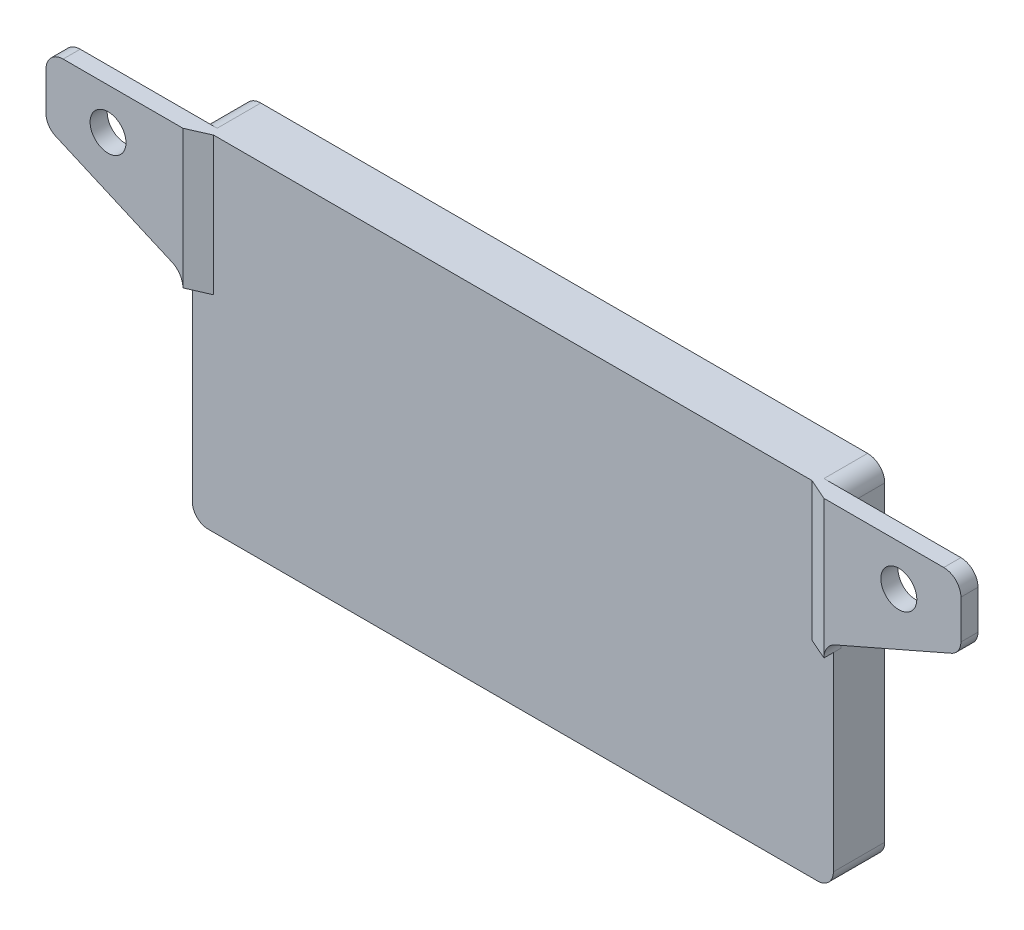
ISO-10303-21;
HEADER;
FILE_DESCRIPTION(('STEP AP214'),'2;1');
FILE_NAME('part.step','',(''),(''),'','','');
FILE_SCHEMA(('AUTOMOTIVE_DESIGN { 1 0 10303 214 1 1 1 1 }'));
ENDSEC;
DATA;
#1=APPLICATION_CONTEXT('core data for automotive mechanical design processes');
#2=APPLICATION_PROTOCOL_DEFINITION('international standard','automotive_design',2000,#1);
#3=PRODUCT_CONTEXT('',#1,'mechanical');
#4=PRODUCT('Part','Part','',(#3));
#5=PRODUCT_RELATED_PRODUCT_CATEGORY('part','',(#4));
#6=PRODUCT_DEFINITION_FORMATION('','',#4);
#7=PRODUCT_DEFINITION_CONTEXT('part definition',#1,'design');
#8=PRODUCT_DEFINITION('design','',#6,#7);
#9=PRODUCT_DEFINITION_SHAPE('','',#8);
#10=(LENGTH_UNIT() NAMED_UNIT(*) SI_UNIT(.MILLI.,.METRE.));
#11=(NAMED_UNIT(*) PLANE_ANGLE_UNIT() SI_UNIT($,.RADIAN.));
#12=(NAMED_UNIT(*) SI_UNIT($,.STERADIAN.) SOLID_ANGLE_UNIT());
#13=UNCERTAINTY_MEASURE_WITH_UNIT(LENGTH_MEASURE(1.E-05),#10,'distance_accuracy_value','');
#14=(GEOMETRIC_REPRESENTATION_CONTEXT(3) GLOBAL_UNCERTAINTY_ASSIGNED_CONTEXT((#13)) GLOBAL_UNIT_ASSIGNED_CONTEXT((#10,
#11,#12)) REPRESENTATION_CONTEXT('',''));
#15=CARTESIAN_POINT('',(0.,0.,0.));
#16=DIRECTION('',(0.,0.,1.));
#17=DIRECTION('',(1.,0.,0.));
#18=AXIS2_PLACEMENT_3D('',#15,#16,#17);
#19=CARTESIAN_POINT('',(-3.05311331771918E-13,7.21644966006352E-13,6.));
#20=DIRECTION('',(0.,0.,-1.));
#21=DIRECTION('',(0.,1.,0.));
#22=AXIS2_PLACEMENT_3D('',#19,#20,#21);
#23=PLANE('',#22);
#24=DIRECTION('',(0.,1.,0.));
#25=VECTOR('',#24,1.);
#26=CARTESIAN_POINT('',(97.4499999999997,133.691968850429,6.00000000000001));
#27=LINE('',#26,#25);
#28=CARTESIAN_POINT('',(97.4499999999997,133.691968850429,6.00000000000001));
#29=VERTEX_POINT('',#28);
#30=CARTESIAN_POINT('',(97.4499999999997,149.850000000001,6.00000000000001));
#31=VERTEX_POINT('',#30);
#32=EDGE_CURVE('E212',#29,#31,#27,.T.);
#33=ORIENTED_EDGE('',*,*,#32,.T.);
#34=DIRECTION('',(1.,0.,0.));
#35=VECTOR('',#34,1.);
#36=CARTESIAN_POINT('',(22.8999999999997,149.850000000001,6.00000000000001));
#37=LINE('',#36,#35);
#38=CARTESIAN_POINT('',(27.5499999999997,149.850000000001,6.00000000000001));
#39=VERTEX_POINT('',#38);
#40=EDGE_CURVE('E284',#39,#31,#37,.T.);
#41=ORIENTED_EDGE('',*,*,#40,.F.);
#42=DIRECTION('',(0.,1.,0.));
#43=VECTOR('',#42,1.);
#44=CARTESIAN_POINT('',(27.5499999999997,133.691968850429,6.00000000000001));
#45=LINE('',#44,#43);
#46=CARTESIAN_POINT('',(27.5499999999997,133.691968850429,6.00000000000001));
#47=VERTEX_POINT('',#46);
#48=EDGE_CURVE('E469',#47,#39,#45,.T.);
#49=ORIENTED_EDGE('',*,*,#48,.F.);
#50=DIRECTION('',(1.,0.,0.));
#51=VECTOR('',#50,1.);
#52=CARTESIAN_POINT('',(0.,133.691968850429,6.00000000000001));
#53=LINE('',#52,#51);
#54=CARTESIAN_POINT('',(25.0499999999997,133.691968850429,6.00000000000001));
#55=VERTEX_POINT('',#54);
#56=EDGE_CURVE('E467',#55,#47,#53,.T.);
#57=ORIENTED_EDGE('',*,*,#56,.F.);
#58=DIRECTION('',(0.,1.,0.));
#59=VECTOR('',#58,1.);
#60=CARTESIAN_POINT('',(25.0499999999997,133.691968850429,6.00000000000001));
#61=LINE('',#60,#59);
#62=CARTESIAN_POINT('',(25.0499999999997,111.500000000001,6.00000000000001));
#63=VERTEX_POINT('',#62);
#64=EDGE_CURVE('E267',#63,#55,#61,.T.);
#65=ORIENTED_EDGE('',*,*,#64,.F.);
#66=CARTESIAN_POINT('',(26.8999999999997,111.500000000001,6.00000000000001));
#67=DIRECTION('',(0.,0.,-1.));
#68=DIRECTION('',(-1.,0.,0.));
#69=AXIS2_PLACEMENT_3D('',#66,#67,#68);
#70=CIRCLE('',#69,1.85000000000001);
#71=CARTESIAN_POINT('',(26.8999999999997,109.650000000001,6.00000000000001));
#72=VERTEX_POINT('',#71);
#73=EDGE_CURVE('E291',#72,#63,#70,.T.);
#74=ORIENTED_EDGE('',*,*,#73,.F.);
#75=DIRECTION('',(-1.,0.,0.));
#76=VECTOR('',#75,1.);
#77=CARTESIAN_POINT('',(26.8999999999997,109.650000000001,6.00000000000001));
#78=LINE('',#77,#76);
#79=CARTESIAN_POINT('',(98.0999999999997,109.650000000001,6.00000000000001));
#80=VERTEX_POINT('',#79);
#81=EDGE_CURVE('E302',#80,#72,#78,.T.);
#82=ORIENTED_EDGE('',*,*,#81,.F.);
#83=CARTESIAN_POINT('',(98.0999999999997,111.500000000001,6.00000000000001));
#84=DIRECTION('',(0.,0.,-1.));
#85=DIRECTION('',(-1.,0.,0.));
#86=AXIS2_PLACEMENT_3D('',#83,#84,#85);
#87=CIRCLE('',#86,1.85);
#88=CARTESIAN_POINT('',(99.9499999999997,111.500000000001,6.00000000000001));
#89=VERTEX_POINT('',#88);
#90=EDGE_CURVE('E230',#89,#80,#87,.T.);
#91=ORIENTED_EDGE('',*,*,#90,.F.);
#92=DIRECTION('',(0.,-1.,0.));
#93=VECTOR('',#92,1.);
#94=CARTESIAN_POINT('',(99.9499999999997,111.500000000001,6.00000000000001));
#95=LINE('',#94,#93);
#96=CARTESIAN_POINT('',(99.9499999999997,133.691968850429,6.00000000000001));
#97=VERTEX_POINT('',#96);
#98=EDGE_CURVE('E219',#97,#89,#95,.T.);
#99=ORIENTED_EDGE('',*,*,#98,.F.);
#100=DIRECTION('',(1.,0.,0.));
#101=VECTOR('',#100,1.);
#102=CARTESIAN_POINT('',(0.,133.691968850429,6.00000000000001));
#103=LINE('',#102,#101);
#104=EDGE_CURVE('E201',#29,#97,#103,.T.);
#105=ORIENTED_EDGE('',*,*,#104,.F.);
#106=EDGE_LOOP('',(#33,#41,#49,#57,#65,#74,#82,#91,#99,#105));
#107=FACE_BOUND('',#106,.T.);
#108=ADVANCED_FACE('F38',(#107),#23,.F.);
#109=CARTESIAN_POINT('',(98.0999999999997,111.500000000001,0.));
#110=DIRECTION('',(0.,0.,1.));
#111=DIRECTION('',(1.,0.,0.));
#112=AXIS2_PLACEMENT_3D('',#109,#110,#111);
#113=PLANE('',#112);
#114=DIRECTION('',(0.,-1.,0.));
#115=VECTOR('',#114,1.);
#116=CARTESIAN_POINT('',(25.0499999999997,148.000000000001,0.));
#117=LINE('',#116,#115);
#118=CARTESIAN_POINT('',(25.0499999999997,147.850000000001,0.));
#119=VERTEX_POINT('',#118);
#120=CARTESIAN_POINT('',(25.0499999999997,111.500000000001,0.));
#121=VERTEX_POINT('',#120);
#122=EDGE_CURVE('E253',#119,#121,#117,.T.);
#123=ORIENTED_EDGE('',*,*,#122,.F.);
#124=CARTESIAN_POINT('',(27.0499999999997,147.850000000001,0.));
#125=DIRECTION('',(0.,0.,1.));
#126=DIRECTION('',(1.,0.,0.));
#127=AXIS2_PLACEMENT_3D('',#124,#125,#126);
#128=CIRCLE('',#127,2.);
#129=CARTESIAN_POINT('',(27.0499999999997,149.850000000001,0.));
#130=VERTEX_POINT('',#129);
#131=EDGE_CURVE('E61',#119,#130,#128,.F.);
#132=ORIENTED_EDGE('',*,*,#131,.T.);
#133=DIRECTION('',(-1.,0.,0.));
#134=VECTOR('',#133,1.);
#135=CARTESIAN_POINT('',(99.9499999999997,149.850000000001,0.));
#136=LINE('',#135,#134);
#137=CARTESIAN_POINT('',(97.9499999999997,149.850000000001,0.));
#138=VERTEX_POINT('',#137);
#139=EDGE_CURVE('E324',#138,#130,#136,.T.);
#140=ORIENTED_EDGE('',*,*,#139,.F.);
#141=CARTESIAN_POINT('',(97.9499999999997,147.850000000001,0.));
#142=DIRECTION('',(0.,0.,1.));
#143=DIRECTION('',(1.,0.,0.));
#144=AXIS2_PLACEMENT_3D('',#141,#142,#143);
#145=CIRCLE('',#144,2.);
#146=CARTESIAN_POINT('',(99.9499999999997,147.850000000001,0.));
#147=VERTEX_POINT('',#146);
#148=EDGE_CURVE('E53',#138,#147,#145,.F.);
#149=ORIENTED_EDGE('',*,*,#148,.T.);
#150=DIRECTION('',(0.,1.,0.));
#151=VECTOR('',#150,1.);
#152=CARTESIAN_POINT('',(99.9499999999997,148.000000000001,0.));
#153=LINE('',#152,#151);
#154=CARTESIAN_POINT('',(99.9499999999997,111.500000000001,0.));
#155=VERTEX_POINT('',#154);
#156=EDGE_CURVE('E322',#155,#147,#153,.T.);
#157=ORIENTED_EDGE('',*,*,#156,.F.);
#158=CARTESIAN_POINT('',(98.0999999999997,111.500000000001,0.));
#159=DIRECTION('',(0.,0.,1.));
#160=DIRECTION('',(1.,0.,0.));
#161=AXIS2_PLACEMENT_3D('',#158,#159,#160);
#162=CIRCLE('',#161,1.85);
#163=CARTESIAN_POINT('',(98.0999999999997,109.650000000001,0.));
#164=VERTEX_POINT('',#163);
#165=EDGE_CURVE('E319',#164,#155,#162,.T.);
#166=ORIENTED_EDGE('',*,*,#165,.F.);
#167=DIRECTION('',(1.,0.,0.));
#168=VECTOR('',#167,1.);
#169=CARTESIAN_POINT('',(26.8999999999997,109.650000000001,0.));
#170=LINE('',#169,#168);
#171=CARTESIAN_POINT('',(26.8999999999997,109.650000000001,0.));
#172=VERTEX_POINT('',#171);
#173=EDGE_CURVE('E316',#172,#164,#170,.T.);
#174=ORIENTED_EDGE('',*,*,#173,.F.);
#175=CARTESIAN_POINT('',(26.8999999999997,111.500000000001,0.));
#176=DIRECTION('',(0.,0.,1.));
#177=DIRECTION('',(1.,0.,0.));
#178=AXIS2_PLACEMENT_3D('',#175,#176,#177);
#179=CIRCLE('',#178,1.85000000000001);
#180=EDGE_CURVE('E313',#121,#172,#179,.T.);
#181=ORIENTED_EDGE('',*,*,#180,.F.);
#182=EDGE_LOOP('',(#123,#132,#140,#149,#157,#166,#174,#181));
#183=FACE_BOUND('',#182,.T.);
#184=ADVANCED_FACE('F383',(#183),#113,.F.);
#185=CARTESIAN_POINT('',(99.9499999999997,149.850000000001,90.1061762461999));
#186=DIRECTION('',(0.,-1.,0.));
#187=DIRECTION('',(1.,0.,0.));
#188=AXIS2_PLACEMENT_3D('',#185,#186,#187);
#189=PLANE('',#188);
#190=DIRECTION('',(0.915315032422767,0.,-0.402738614266015));
#191=VECTOR('',#190,1.);
#192=CARTESIAN_POINT('',(6.68036193029476,149.850000000001,15.1826407506701));
#193=LINE('',#192,#191);
#194=CARTESIAN_POINT('',(25.0499999999997,149.850000000001,7.1));
#195=VERTEX_POINT('',#194);
#196=EDGE_CURVE('E528',#195,#39,#193,.T.);
#197=ORIENTED_EDGE('',*,*,#196,.T.);
#198=ORIENTED_EDGE('',*,*,#40,.T.);
#199=DIRECTION('',(-0.915315032422766,0.,-0.402738614266016));
#200=VECTOR('',#199,1.);
#201=CARTESIAN_POINT('',(13.5944369973188,149.850000000001,-30.8964477211794));
#202=LINE('',#201,#200);
#203=CARTESIAN_POINT('',(99.9499999999997,149.850000000001,7.1));
#204=VERTEX_POINT('',#203);
#205=EDGE_CURVE('E432',#204,#31,#202,.T.);
#206=ORIENTED_EDGE('',*,*,#205,.F.);
#207=DIRECTION('',(-1.,-2.06184276001815E-13,0.));
#208=VECTOR('',#207,1.);
#209=CARTESIAN_POINT('',(99.9499999999997,149.850000000001,7.1));
#210=LINE('',#209,#208);
#211=CARTESIAN_POINT('',(113.95,149.850000000004,7.1));
#212=VERTEX_POINT('',#211);
#213=EDGE_CURVE('E430',#212,#204,#210,.T.);
#214=ORIENTED_EDGE('',*,*,#213,.F.);
#215=DIRECTION('',(0.,0.,-1.));
#216=VECTOR('',#215,1.);
#217=CARTESIAN_POINT('',(113.95,149.850000000001,90.1061762461999));
#218=LINE('',#217,#216);
#219=CARTESIAN_POINT('',(113.95,149.850000000004,5.1));
#220=VERTEX_POINT('',#219);
#221=EDGE_CURVE('E342',#212,#220,#218,.T.);
#222=ORIENTED_EDGE('',*,*,#221,.T.);
#223=DIRECTION('',(-1.,0.,0.));
#224=VECTOR('',#223,1.);
#225=CARTESIAN_POINT('',(22.8999999999997,149.850000000001,5.1));
#226=LINE('',#225,#224);
#227=CARTESIAN_POINT('',(97.9499999999997,149.850000000003,5.1));
#228=VERTEX_POINT('',#227);
#229=EDGE_CURVE('E279',#220,#228,#226,.T.);
#230=ORIENTED_EDGE('',*,*,#229,.T.);
#231=DIRECTION('',(0.,0.,-1.));
#232=VECTOR('',#231,1.);
#233=CARTESIAN_POINT('',(97.9499999999997,149.850000000001,90.1061762461999));
#234=LINE('',#233,#232);
#235=EDGE_CURVE('E311',#228,#138,#234,.T.);
#236=ORIENTED_EDGE('',*,*,#235,.T.);
#237=ORIENTED_EDGE('',*,*,#139,.T.);
#238=DIRECTION('',(0.,0.,-1.));
#239=VECTOR('',#238,1.);
#240=CARTESIAN_POINT('',(27.0499999999997,149.850000000001,90.1061762461999));
#241=LINE('',#240,#239);
#242=CARTESIAN_POINT('',(27.0499999999997,149.850000000001,5.1));
#243=VERTEX_POINT('',#242);
#244=EDGE_CURVE('E337',#130,#243,#241,.F.);
#245=ORIENTED_EDGE('',*,*,#244,.T.);
#246=CARTESIAN_POINT('',(11.0499999999997,149.850000000001,5.1));
#247=VERTEX_POINT('',#246);
#248=EDGE_CURVE('E280',#243,#247,#226,.T.);
#249=ORIENTED_EDGE('',*,*,#248,.T.);
#250=DIRECTION('',(0.,0.,-1.));
#251=VECTOR('',#250,1.);
#252=CARTESIAN_POINT('',(11.0499999999997,149.850000000001,90.1061762461999));
#253=LINE('',#252,#251);
#254=CARTESIAN_POINT('',(11.0499999999997,149.850000000001,7.1));
#255=VERTEX_POINT('',#254);
#256=EDGE_CURVE('E340',#247,#255,#253,.F.);
#257=ORIENTED_EDGE('',*,*,#256,.T.);
#258=DIRECTION('',(-1.,0.,0.));
#259=VECTOR('',#258,1.);
#260=CARTESIAN_POINT('',(11.0499999999997,149.850000000001,7.1));
#261=LINE('',#260,#259);
#262=EDGE_CURVE('E506',#195,#255,#261,.T.);
#263=ORIENTED_EDGE('',*,*,#262,.F.);
#264=EDGE_LOOP('',(#197,#198,#206,#214,#222,#230,#236,#237,#245,#249,#257,#263));
#265=FACE_BOUND('',#264,.T.);
#266=ADVANCED_FACE('F388',(#265),#189,.F.);
#267=CARTESIAN_POINT('',(99.9499999999997,148.000000000001,90.1061762461999));
#268=DIRECTION('',(-1.,0.,0.));
#269=DIRECTION('',(0.,0.,1.));
#270=AXIS2_PLACEMENT_3D('',#267,#268,#269);
#271=PLANE('',#270);
#272=ORIENTED_EDGE('',*,*,#156,.T.);
#273=DIRECTION('',(0.,0.,-1.));
#274=VECTOR('',#273,1.);
#275=CARTESIAN_POINT('',(99.9499999999997,147.850000000001,90.1061762461999));
#276=LINE('',#275,#274);
#277=CARTESIAN_POINT('',(99.9499999999997,147.850000000001,5.10000000000001));
#278=VERTEX_POINT('',#277);
#279=EDGE_CURVE('E358',#147,#278,#276,.F.);
#280=ORIENTED_EDGE('',*,*,#279,.T.);
#281=DIRECTION('',(0.,-1.,0.));
#282=VECTOR('',#281,1.);
#283=CARTESIAN_POINT('',(99.9499999999997,148.000000000001,5.10000000000001));
#284=LINE('',#283,#282);
#285=CARTESIAN_POINT('',(99.9499999999997,133.691968850429,5.1));
#286=VERTEX_POINT('',#285);
#287=EDGE_CURVE('E221',#278,#286,#284,.T.);
#288=ORIENTED_EDGE('',*,*,#287,.T.);
#289=DIRECTION('',(0.,0.,-1.));
#290=VECTOR('',#289,1.);
#291=CARTESIAN_POINT('',(99.9499999999997,133.691968850429,120.208800011208));
#292=LINE('',#291,#290);
#293=EDGE_CURVE('E217',#97,#286,#292,.T.);
#294=ORIENTED_EDGE('',*,*,#293,.F.);
#295=ORIENTED_EDGE('',*,*,#98,.T.);
#296=DIRECTION('',(0.,0.,-1.));
#297=VECTOR('',#296,1.);
#298=CARTESIAN_POINT('',(99.9499999999997,111.500000000001,90.1061762461999));
#299=LINE('',#298,#297);
#300=EDGE_CURVE('E327',#89,#155,#299,.T.);
#301=ORIENTED_EDGE('',*,*,#300,.T.);
#302=EDGE_LOOP('',(#272,#280,#288,#294,#295,#301));
#303=FACE_BOUND('',#302,.T.);
#304=ADVANCED_FACE('F218',(#303),#271,.F.);
#305=CARTESIAN_POINT('',(98.0999999999997,111.500000000001,90.1061762461999));
#306=DIRECTION('',(0.,0.,-1.));
#307=DIRECTION('',(-1.,0.,0.));
#308=AXIS2_PLACEMENT_3D('',#305,#306,#307);
#309=CYLINDRICAL_SURFACE('',#308,1.85);
#310=ORIENTED_EDGE('',*,*,#300,.F.);
#311=ORIENTED_EDGE('',*,*,#90,.T.);
#312=DIRECTION('',(0.,0.,-1.));
#313=VECTOR('',#312,1.);
#314=CARTESIAN_POINT('',(98.0999999999997,109.650000000001,90.1061762461999));
#315=LINE('',#314,#313);
#316=EDGE_CURVE('E329',#80,#164,#315,.T.);
#317=ORIENTED_EDGE('',*,*,#316,.T.);
#318=ORIENTED_EDGE('',*,*,#165,.T.);
#319=EDGE_LOOP('',(#310,#311,#317,#318));
#320=FACE_BOUND('',#319,.T.);
#321=ADVANCED_FACE('F399',(#320),#309,.T.);
#322=CARTESIAN_POINT('',(26.8999999999997,109.650000000001,90.1061762461999));
#323=DIRECTION('',(0.,1.,0.));
#324=DIRECTION('',(0.,0.,1.));
#325=AXIS2_PLACEMENT_3D('',#322,#323,#324);
#326=PLANE('',#325);
#327=ORIENTED_EDGE('',*,*,#316,.F.);
#328=ORIENTED_EDGE('',*,*,#81,.T.);
#329=DIRECTION('',(0.,0.,-1.));
#330=VECTOR('',#329,1.);
#331=CARTESIAN_POINT('',(26.8999999999997,109.650000000001,90.1061762461999));
#332=LINE('',#331,#330);
#333=EDGE_CURVE('E331',#72,#172,#332,.T.);
#334=ORIENTED_EDGE('',*,*,#333,.T.);
#335=ORIENTED_EDGE('',*,*,#173,.T.);
#336=EDGE_LOOP('',(#327,#328,#334,#335));
#337=FACE_BOUND('',#336,.T.);
#338=ADVANCED_FACE('F402',(#337),#326,.F.);
#339=CARTESIAN_POINT('',(26.8999999999997,111.500000000001,90.1061762461999));
#340=DIRECTION('',(0.,0.,-1.));
#341=DIRECTION('',(-1.,0.,0.));
#342=AXIS2_PLACEMENT_3D('',#339,#340,#341);
#343=CYLINDRICAL_SURFACE('',#342,1.85000000000001);
#344=ORIENTED_EDGE('',*,*,#333,.F.);
#345=ORIENTED_EDGE('',*,*,#73,.T.);
#346=DIRECTION('',(0.,0.,-1.));
#347=VECTOR('',#346,1.);
#348=CARTESIAN_POINT('',(25.0499999999997,111.500000000001,90.1061762461999));
#349=LINE('',#348,#347);
#350=EDGE_CURVE('E308',#63,#121,#349,.T.);
#351=ORIENTED_EDGE('',*,*,#350,.T.);
#352=ORIENTED_EDGE('',*,*,#180,.T.);
#353=EDGE_LOOP('',(#344,#345,#351,#352));
#354=FACE_BOUND('',#353,.T.);
#355=ADVANCED_FACE('F406',(#354),#343,.T.);
#356=CARTESIAN_POINT('',(25.0499999999997,148.000000000001,90.1061762461999));
#357=DIRECTION('',(1.,0.,0.));
#358=DIRECTION('',(0.,0.,-1.));
#359=AXIS2_PLACEMENT_3D('',#356,#357,#358);
#360=PLANE('',#359);
#361=DIRECTION('',(0.,1.,0.));
#362=VECTOR('',#361,1.);
#363=CARTESIAN_POINT('',(25.0499999999997,148.000000000001,5.10000000000001));
#364=LINE('',#363,#362);
#365=CARTESIAN_POINT('',(25.0499999999997,133.691968850429,5.1));
#366=VERTEX_POINT('',#365);
#367=CARTESIAN_POINT('',(25.0499999999997,147.850000000001,5.10000000000001));
#368=VERTEX_POINT('',#367);
#369=EDGE_CURVE('E307',#366,#368,#364,.T.);
#370=ORIENTED_EDGE('',*,*,#369,.T.);
#371=DIRECTION('',(0.,0.,-1.));
#372=VECTOR('',#371,1.);
#373=CARTESIAN_POINT('',(25.0499999999997,147.850000000001,90.1061762461999));
#374=LINE('',#373,#372);
#375=EDGE_CURVE('E354',#368,#119,#374,.T.);
#376=ORIENTED_EDGE('',*,*,#375,.T.);
#377=ORIENTED_EDGE('',*,*,#122,.T.);
#378=ORIENTED_EDGE('',*,*,#350,.F.);
#379=ORIENTED_EDGE('',*,*,#64,.T.);
#380=DIRECTION('',(0.,0.,-1.));
#381=VECTOR('',#380,1.);
#382=CARTESIAN_POINT('',(25.0499999999997,133.691968850429,120.208800011208));
#383=LINE('',#382,#381);
#384=EDGE_CURVE('E289',#55,#366,#383,.T.);
#385=ORIENTED_EDGE('',*,*,#384,.T.);
#386=EDGE_LOOP('',(#370,#376,#377,#378,#379,#385));
#387=FACE_BOUND('',#386,.T.);
#388=ADVANCED_FACE('F367',(#387),#360,.F.);
#389=CARTESIAN_POINT('',(10.8999999999997,143.308031149572,5.1));
#390=DIRECTION('',(0.,0.,1.));
#391=DIRECTION('',(1.,0.,0.));
#392=AXIS2_PLACEMENT_3D('',#389,#390,#391);
#393=PLANE('',#392);
#394=ORIENTED_EDGE('',*,*,#229,.F.);
#395=CARTESIAN_POINT('',(113.95,147.850000000001,5.10000000000001));
#396=DIRECTION('',(0.,0.,1.));
#397=DIRECTION('',(1.,0.,0.));
#398=AXIS2_PLACEMENT_3D('',#395,#396,#397);
#399=CIRCLE('',#398,2.);
#400=CARTESIAN_POINT('',(115.95,147.850000000001,5.1));
#401=VERTEX_POINT('',#400);
#402=EDGE_CURVE('E345',#220,#401,#399,.F.);
#403=ORIENTED_EDGE('',*,*,#402,.T.);
#404=DIRECTION('',(0.,1.,0.));
#405=VECTOR('',#404,1.);
#406=CARTESIAN_POINT('',(115.95,148.000000000001,5.1));
#407=LINE('',#406,#405);
#408=CARTESIAN_POINT('',(115.95,143.308031149572,5.1));
#409=VERTEX_POINT('',#408);
#410=EDGE_CURVE('E250',#409,#401,#407,.T.);
#411=ORIENTED_EDGE('',*,*,#410,.F.);
#412=CARTESIAN_POINT('',(114.1,143.308031149572,5.1));
#413=DIRECTION('',(0.,0.,1.));
#414=DIRECTION('',(1.,0.,0.));
#415=AXIS2_PLACEMENT_3D('',#412,#413,#414);
#416=CIRCLE('',#415,1.85);
#417=CARTESIAN_POINT('',(114.841514842936,141.613140080003,5.1));
#418=VERTEX_POINT('',#417);
#419=EDGE_CURVE('E255',#418,#409,#416,.T.);
#420=ORIENTED_EDGE('',*,*,#419,.F.);
#421=DIRECTION('',(0.91615733490219,0.400818834019706,0.));
#422=VECTOR('',#421,1.);
#423=CARTESIAN_POINT('',(101.238239506857,135.661707120469,5.1));
#424=LINE('',#423,#422);
#425=CARTESIAN_POINT('',(101.238239506857,135.661707120469,5.1));
#426=VERTEX_POINT('',#425);
#427=EDGE_CURVE('E259',#426,#418,#424,.T.);
#428=ORIENTED_EDGE('',*,*,#427,.F.);
#429=CARTESIAN_POINT('',(102.1,133.691968850429,5.1));
#430=DIRECTION('',(0.,0.,-1.));
#431=DIRECTION('',(1.,0.,0.));
#432=AXIS2_PLACEMENT_3D('',#429,#430,#431);
#433=CIRCLE('',#432,2.15000000000001);
#434=EDGE_CURVE('E225',#286,#426,#433,.T.);
#435=ORIENTED_EDGE('',*,*,#434,.F.);
#436=ORIENTED_EDGE('',*,*,#287,.F.);
#437=CARTESIAN_POINT('',(97.9499999999997,147.850000000001,5.10000000000001));
#438=DIRECTION('',(0.,0.,1.));
#439=DIRECTION('',(1.,0.,0.));
#440=AXIS2_PLACEMENT_3D('',#437,#438,#439);
#441=CIRCLE('',#440,2.);
#442=EDGE_CURVE('E12',#278,#228,#441,.T.);
#443=ORIENTED_EDGE('',*,*,#442,.T.);
#444=EDGE_LOOP('',(#394,#403,#411,#420,#428,#435,#436,#443));
#445=FACE_BOUND('',#444,.T.);
#446=CARTESIAN_POINT('',(108.7,145.050000000001,5.1));
#447=DIRECTION('',(0.,0.,1.));
#448=DIRECTION('',(1.,0.,0.));
#449=AXIS2_PLACEMENT_3D('',#446,#447,#448);
#450=CIRCLE('',#449,2.1);
#451=CARTESIAN_POINT('',(110.8,145.050000000001,5.1));
#452=VERTEX_POINT('',#451);
#453=EDGE_CURVE('E239',#452,#452,#450,.T.);
#454=ORIENTED_EDGE('',*,*,#453,.T.);
#455=EDGE_LOOP('',(#454));
#456=FACE_BOUND('',#455,.T.);
#457=ADVANCED_FACE('F413',(#445,#456),#393,.F.);
#458=DIRECTION('',(0.,-1.,0.));
#459=VECTOR('',#458,1.);
#460=CARTESIAN_POINT('',(9.04999999999969,148.000000000001,5.1));
#461=LINE('',#460,#459);
#462=CARTESIAN_POINT('',(9.04999999999969,147.850000000001,5.1));
#463=VERTEX_POINT('',#462);
#464=CARTESIAN_POINT('',(9.04999999999969,143.308031149572,5.1));
#465=VERTEX_POINT('',#464);
#466=EDGE_CURVE('E277',#463,#465,#461,.T.);
#467=ORIENTED_EDGE('',*,*,#466,.F.);
#468=CARTESIAN_POINT('',(11.0499999999997,147.850000000001,5.10000000000001));
#469=DIRECTION('',(0.,0.,1.));
#470=DIRECTION('',(1.,0.,0.));
#471=AXIS2_PLACEMENT_3D('',#468,#469,#470);
#472=CIRCLE('',#471,2.);
#473=EDGE_CURVE('E352',#463,#247,#472,.F.);
#474=ORIENTED_EDGE('',*,*,#473,.T.);
#475=ORIENTED_EDGE('',*,*,#248,.F.);
#476=CARTESIAN_POINT('',(27.0499999999997,147.850000000001,5.10000000000001));
#477=DIRECTION('',(0.,0.,1.));
#478=DIRECTION('',(1.,0.,0.));
#479=AXIS2_PLACEMENT_3D('',#476,#477,#478);
#480=CIRCLE('',#479,2.);
#481=EDGE_CURVE('E46',#243,#368,#480,.T.);
#482=ORIENTED_EDGE('',*,*,#481,.T.);
#483=ORIENTED_EDGE('',*,*,#369,.F.);
#484=CARTESIAN_POINT('',(22.8999999999997,133.691968850429,5.1));
#485=DIRECTION('',(0.,0.,-1.));
#486=DIRECTION('',(1.,0.,0.));
#487=AXIS2_PLACEMENT_3D('',#484,#485,#486);
#488=CIRCLE('',#487,2.15);
#489=CARTESIAN_POINT('',(23.7617604931421,135.661707120469,5.1));
#490=VERTEX_POINT('',#489);
#491=EDGE_CURVE('E264',#490,#366,#488,.T.);
#492=ORIENTED_EDGE('',*,*,#491,.F.);
#493=DIRECTION('',(0.91615733490219,-0.400818834019706,0.));
#494=VECTOR('',#493,1.);
#495=CARTESIAN_POINT('',(10.1584851570632,141.613140080003,5.1));
#496=LINE('',#495,#494);
#497=CARTESIAN_POINT('',(10.1584851570632,141.613140080003,5.1));
#498=VERTEX_POINT('',#497);
#499=EDGE_CURVE('E269',#498,#490,#496,.T.);
#500=ORIENTED_EDGE('',*,*,#499,.F.);
#501=CARTESIAN_POINT('',(10.8999999999997,143.308031149572,5.1));
#502=DIRECTION('',(0.,0.,1.));
#503=DIRECTION('',(1.,0.,0.));
#504=AXIS2_PLACEMENT_3D('',#501,#502,#503);
#505=CIRCLE('',#504,1.85);
#506=EDGE_CURVE('E273',#465,#498,#505,.T.);
#507=ORIENTED_EDGE('',*,*,#506,.F.);
#508=EDGE_LOOP('',(#467,#474,#475,#482,#483,#492,#500,#507));
#509=FACE_BOUND('',#508,.T.);
#510=CARTESIAN_POINT('',(16.2999999999997,145.050000000001,5.1));
#511=DIRECTION('',(0.,0.,1.));
#512=DIRECTION('',(1.,0.,0.));
#513=AXIS2_PLACEMENT_3D('',#510,#511,#512);
#514=CIRCLE('',#513,2.1);
#515=CARTESIAN_POINT('',(18.3999999999997,145.050000000001,5.1));
#516=VERTEX_POINT('',#515);
#517=EDGE_CURVE('E236',#516,#516,#514,.T.);
#518=ORIENTED_EDGE('',*,*,#517,.T.);
#519=EDGE_LOOP('',(#518));
#520=FACE_BOUND('',#519,.T.);
#521=ADVANCED_FACE('F362',(#509,#520),#393,.F.);
#522=CARTESIAN_POINT('',(9.04999999999969,148.000000000001,120.208800011208));
#523=DIRECTION('',(1.,0.,0.));
#524=DIRECTION('',(0.,0.,-1.));
#525=AXIS2_PLACEMENT_3D('',#522,#523,#524);
#526=PLANE('',#525);
#527=DIRECTION('',(0.,0.,-1.));
#528=VECTOR('',#527,1.);
#529=CARTESIAN_POINT('',(9.04999999999969,143.308031149572,120.208800011208));
#530=LINE('',#529,#528);
#531=CARTESIAN_POINT('',(9.04999999999969,143.308031149572,7.1));
#532=VERTEX_POINT('',#531);
#533=EDGE_CURVE('E276',#532,#465,#530,.T.);
#534=ORIENTED_EDGE('',*,*,#533,.F.);
#535=DIRECTION('',(0.,-1.,0.));
#536=VECTOR('',#535,1.);
#537=CARTESIAN_POINT('',(9.04999999999969,143.308031149572,7.1));
#538=LINE('',#537,#536);
#539=CARTESIAN_POINT('',(9.04999999999969,147.850000000001,7.1));
#540=VERTEX_POINT('',#539);
#541=EDGE_CURVE('E496',#540,#532,#538,.T.);
#542=ORIENTED_EDGE('',*,*,#541,.F.);
#543=DIRECTION('',(0.,0.,-1.));
#544=VECTOR('',#543,1.);
#545=CARTESIAN_POINT('',(9.04999999999969,147.850000000001,120.208800011208));
#546=LINE('',#545,#544);
#547=EDGE_CURVE('E349',#540,#463,#546,.T.);
#548=ORIENTED_EDGE('',*,*,#547,.T.);
#549=ORIENTED_EDGE('',*,*,#466,.T.);
#550=EDGE_LOOP('',(#534,#542,#548,#549));
#551=FACE_BOUND('',#550,.T.);
#552=ADVANCED_FACE('F495',(#551),#526,.F.);
#553=CARTESIAN_POINT('',(10.8999999999997,143.308031149572,120.208800011208));
#554=DIRECTION('',(0.,0.,-1.));
#555=DIRECTION('',(-1.,0.,0.));
#556=AXIS2_PLACEMENT_3D('',#553,#554,#555);
#557=CYLINDRICAL_SURFACE('',#556,1.85);
#558=DIRECTION('',(0.,0.,-1.));
#559=VECTOR('',#558,1.);
#560=CARTESIAN_POINT('',(10.1584851570632,141.613140080003,120.208800011208));
#561=LINE('',#560,#559);
#562=CARTESIAN_POINT('',(10.1584851570632,141.613140080003,7.1));
#563=VERTEX_POINT('',#562);
#564=EDGE_CURVE('E272',#563,#498,#561,.T.);
#565=ORIENTED_EDGE('',*,*,#564,.F.);
#566=CARTESIAN_POINT('',(10.8999999999997,143.308031149572,7.1));
#567=DIRECTION('',(0.,0.,1.));
#568=DIRECTION('',(1.,0.,0.));
#569=AXIS2_PLACEMENT_3D('',#566,#567,#568);
#570=CIRCLE('',#569,1.85);
#571=EDGE_CURVE('E491',#532,#563,#570,.T.);
#572=ORIENTED_EDGE('',*,*,#571,.F.);
#573=ORIENTED_EDGE('',*,*,#533,.T.);
#574=ORIENTED_EDGE('',*,*,#506,.T.);
#575=EDGE_LOOP('',(#565,#572,#573,#574));
#576=FACE_BOUND('',#575,.T.);
#577=ADVANCED_FACE('F490',(#576),#557,.T.);
#578=CARTESIAN_POINT('',(10.1584851570632,141.613140080003,120.208800011208));
#579=DIRECTION('',(0.400818834019706,0.91615733490219,0.));
#580=DIRECTION('',(-0.91615733490219,0.400818834019706,0.));
#581=AXIS2_PLACEMENT_3D('',#578,#579,#580);
#582=PLANE('',#581);
#583=DIRECTION('',(0.,0.,-1.));
#584=VECTOR('',#583,1.);
#585=CARTESIAN_POINT('',(23.7617604931421,135.661707120469,120.208800011208));
#586=LINE('',#585,#584);
#587=CARTESIAN_POINT('',(23.7617604931421,135.661707120469,7.1));
#588=VERTEX_POINT('',#587);
#589=EDGE_CURVE('E268',#588,#490,#586,.T.);
#590=ORIENTED_EDGE('',*,*,#589,.F.);
#591=DIRECTION('',(0.91615733490219,-0.400818834019706,0.));
#592=VECTOR('',#591,1.);
#593=CARTESIAN_POINT('',(23.7617604931421,135.661707120469,7.1));
#594=LINE('',#593,#592);
#595=EDGE_CURVE('E486',#563,#588,#594,.T.);
#596=ORIENTED_EDGE('',*,*,#595,.F.);
#597=ORIENTED_EDGE('',*,*,#564,.T.);
#598=ORIENTED_EDGE('',*,*,#499,.T.);
#599=EDGE_LOOP('',(#590,#596,#597,#598));
#600=FACE_BOUND('',#599,.T.);
#601=ADVANCED_FACE('F483',(#600),#582,.F.);
#602=CARTESIAN_POINT('',(22.8999999999997,133.691968850429,120.208800011208));
#603=DIRECTION('',(0.,0.,-1.));
#604=DIRECTION('',(-1.,0.,0.));
#605=AXIS2_PLACEMENT_3D('',#602,#603,#604);
#606=CYLINDRICAL_SURFACE('',#605,2.15);
#607=ORIENTED_EDGE('',*,*,#384,.F.);
#608=DIRECTION('',(0.,0.,-1.));
#609=VECTOR('',#608,1.);
#610=CARTESIAN_POINT('',(25.0499999999997,133.691968850429,31.8394364624691));
#611=LINE('',#610,#609);
#612=CARTESIAN_POINT('',(25.0499999999997,133.691968850429,7.1));
#613=VERTEX_POINT('',#612);
#614=EDGE_CURVE('E249',#613,#55,#611,.T.);
#615=ORIENTED_EDGE('',*,*,#614,.F.);
#616=CARTESIAN_POINT('',(22.8999999999997,133.691968850429,7.1));
#617=DIRECTION('',(0.,0.,1.));
#618=DIRECTION('',(1.,0.,0.));
#619=AXIS2_PLACEMENT_3D('',#616,#617,#618);
#620=CIRCLE('',#619,2.15);
#621=EDGE_CURVE('E511',#588,#613,#620,.F.);
#622=ORIENTED_EDGE('',*,*,#621,.F.);
#623=ORIENTED_EDGE('',*,*,#589,.T.);
#624=ORIENTED_EDGE('',*,*,#491,.T.);
#625=EDGE_LOOP('',(#607,#615,#622,#623,#624));
#626=FACE_BOUND('',#625,.T.);
#627=ADVANCED_FACE('F477',(#626),#606,.F.);
#628=CARTESIAN_POINT('',(102.1,133.691968850429,120.208800011208));
#629=DIRECTION('',(0.,0.,-1.));
#630=DIRECTION('',(-1.,0.,0.));
#631=AXIS2_PLACEMENT_3D('',#628,#629,#630);
#632=CYLINDRICAL_SURFACE('',#631,2.15000000000001);
#633=DIRECTION('',(0.,0.,-1.));
#634=VECTOR('',#633,1.);
#635=CARTESIAN_POINT('',(101.238239506857,135.661707120469,120.208800011208));
#636=LINE('',#635,#634);
#637=CARTESIAN_POINT('',(101.238239506857,135.661707120469,7.1));
#638=VERTEX_POINT('',#637);
#639=EDGE_CURVE('E262',#638,#426,#636,.T.);
#640=ORIENTED_EDGE('',*,*,#639,.F.);
#641=CARTESIAN_POINT('',(102.1,133.691968850429,7.1));
#642=DIRECTION('',(0.,0.,1.));
#643=DIRECTION('',(1.,0.,0.));
#644=AXIS2_PLACEMENT_3D('',#641,#642,#643);
#645=CIRCLE('',#644,2.15000000000001);
#646=CARTESIAN_POINT('',(99.9499999999997,133.691968850429,7.1));
#647=VERTEX_POINT('',#646);
#648=EDGE_CURVE('E234',#647,#638,#645,.F.);
#649=ORIENTED_EDGE('',*,*,#648,.F.);
#650=DIRECTION('',(0.,0.,-1.));
#651=VECTOR('',#650,1.);
#652=CARTESIAN_POINT('',(99.9499999999997,133.691968850429,31.8394364624691));
#653=LINE('',#652,#651);
#654=EDGE_CURVE('E205',#647,#97,#653,.T.);
#655=ORIENTED_EDGE('',*,*,#654,.T.);
#656=ORIENTED_EDGE('',*,*,#293,.T.);
#657=ORIENTED_EDGE('',*,*,#434,.T.);
#658=EDGE_LOOP('',(#640,#649,#655,#656,#657));
#659=FACE_BOUND('',#658,.T.);
#660=ADVANCED_FACE('F232',(#659),#632,.F.);
#661=CARTESIAN_POINT('',(101.238239506857,135.661707120469,120.208800011208));
#662=DIRECTION('',(-0.400818834019706,0.91615733490219,0.));
#663=DIRECTION('',(-0.91615733490219,-0.400818834019706,0.));
#664=AXIS2_PLACEMENT_3D('',#661,#662,#663);
#665=PLANE('',#664);
#666=DIRECTION('',(0.,0.,-1.));
#667=VECTOR('',#666,1.);
#668=CARTESIAN_POINT('',(114.841514842936,141.613140080003,120.208800011208));
#669=LINE('',#668,#667);
#670=CARTESIAN_POINT('',(114.841514842936,141.613140080003,7.1));
#671=VERTEX_POINT('',#670);
#672=EDGE_CURVE('E258',#671,#418,#669,.T.);
#673=ORIENTED_EDGE('',*,*,#672,.F.);
#674=DIRECTION('',(0.91615733490219,0.400818834019706,0.));
#675=VECTOR('',#674,1.);
#676=CARTESIAN_POINT('',(114.841514842936,141.613140080003,7.1));
#677=LINE('',#676,#675);
#678=EDGE_CURVE('E241',#638,#671,#677,.T.);
#679=ORIENTED_EDGE('',*,*,#678,.F.);
#680=ORIENTED_EDGE('',*,*,#639,.T.);
#681=ORIENTED_EDGE('',*,*,#427,.T.);
#682=EDGE_LOOP('',(#673,#679,#680,#681));
#683=FACE_BOUND('',#682,.T.);
#684=ADVANCED_FACE('F447',(#683),#665,.F.);
#685=CARTESIAN_POINT('',(114.1,143.308031149572,120.208800011208));
#686=DIRECTION('',(0.,0.,-1.));
#687=DIRECTION('',(-1.,0.,0.));
#688=AXIS2_PLACEMENT_3D('',#685,#686,#687);
#689=CYLINDRICAL_SURFACE('',#688,1.85);
#690=DIRECTION('',(0.,0.,-1.));
#691=VECTOR('',#690,1.);
#692=CARTESIAN_POINT('',(115.95,143.308031149572,120.208800011208));
#693=LINE('',#692,#691);
#694=CARTESIAN_POINT('',(115.95,143.308031149572,7.1));
#695=VERTEX_POINT('',#694);
#696=EDGE_CURVE('E254',#695,#409,#693,.T.);
#697=ORIENTED_EDGE('',*,*,#696,.F.);
#698=CARTESIAN_POINT('',(114.1,143.308031149572,7.1));
#699=DIRECTION('',(0.,0.,1.));
#700=DIRECTION('',(1.,0.,0.));
#701=AXIS2_PLACEMENT_3D('',#698,#699,#700);
#702=CIRCLE('',#701,1.85);
#703=EDGE_CURVE('E439',#671,#695,#702,.T.);
#704=ORIENTED_EDGE('',*,*,#703,.F.);
#705=ORIENTED_EDGE('',*,*,#672,.T.);
#706=ORIENTED_EDGE('',*,*,#419,.T.);
#707=EDGE_LOOP('',(#697,#704,#705,#706));
#708=FACE_BOUND('',#707,.T.);
#709=ADVANCED_FACE('F451',(#708),#689,.T.);
#710=CARTESIAN_POINT('',(115.95,148.000000000001,120.208800011208));
#711=DIRECTION('',(-1.,0.,0.));
#712=DIRECTION('',(0.,0.,1.));
#713=AXIS2_PLACEMENT_3D('',#710,#711,#712);
#714=PLANE('',#713);
#715=ORIENTED_EDGE('',*,*,#410,.T.);
#716=DIRECTION('',(0.,0.,-1.));
#717=VECTOR('',#716,1.);
#718=CARTESIAN_POINT('',(115.95,147.850000000001,120.208800011208));
#719=LINE('',#718,#717);
#720=CARTESIAN_POINT('',(115.950000000001,147.850000000001,7.1));
#721=VERTEX_POINT('',#720);
#722=EDGE_CURVE('E347',#401,#721,#719,.F.);
#723=ORIENTED_EDGE('',*,*,#722,.T.);
#724=DIRECTION('',(0.,1.,0.));
#725=VECTOR('',#724,1.);
#726=CARTESIAN_POINT('',(115.95,147.850000000001,7.1));
#727=LINE('',#726,#725);
#728=EDGE_CURVE('E437',#695,#721,#727,.T.);
#729=ORIENTED_EDGE('',*,*,#728,.F.);
#730=ORIENTED_EDGE('',*,*,#696,.T.);
#731=EDGE_LOOP('',(#715,#723,#729,#730));
#732=FACE_BOUND('',#731,.T.);
#733=ADVANCED_FACE('F454',(#732),#714,.F.);
#734=CARTESIAN_POINT('',(16.2999999999997,145.050000000001,120.208800011208));
#735=DIRECTION('',(0.,0.,-1.));
#736=DIRECTION('',(-1.,0.,0.));
#737=AXIS2_PLACEMENT_3D('',#734,#735,#736);
#738=CYLINDRICAL_SURFACE('',#737,2.1);
#739=ORIENTED_EDGE('',*,*,#517,.F.);
#740=EDGE_LOOP('',(#739));
#741=FACE_BOUND('',#740,.T.);
#742=CARTESIAN_POINT('',(16.2999999999997,145.050000000001,7.1));
#743=DIRECTION('',(0.,0.,1.));
#744=DIRECTION('',(1.,0.,0.));
#745=AXIS2_PLACEMENT_3D('',#742,#743,#744);
#746=CIRCLE('',#745,2.09999999999999);
#747=CARTESIAN_POINT('',(18.3999999999997,145.050000000001,7.1));
#748=VERTEX_POINT('',#747);
#749=EDGE_CURVE('E509',#748,#748,#746,.T.);
#750=ORIENTED_EDGE('',*,*,#749,.T.);
#751=EDGE_LOOP('',(#750));
#752=FACE_BOUND('',#751,.T.);
#753=ADVANCED_FACE('F419',(#741,#752),#738,.F.);
#754=CARTESIAN_POINT('',(108.7,145.050000000001,120.208800011208));
#755=DIRECTION('',(0.,0.,-1.));
#756=DIRECTION('',(-1.,0.,0.));
#757=AXIS2_PLACEMENT_3D('',#754,#755,#756);
#758=CYLINDRICAL_SURFACE('',#757,2.1);
#759=ORIENTED_EDGE('',*,*,#453,.F.);
#760=EDGE_LOOP('',(#759));
#761=FACE_BOUND('',#760,.T.);
#762=CARTESIAN_POINT('',(108.7,145.050000000001,7.1));
#763=DIRECTION('',(0.,0.,1.));
#764=DIRECTION('',(1.,0.,0.));
#765=AXIS2_PLACEMENT_3D('',#762,#763,#764);
#766=CIRCLE('',#765,2.1);
#767=CARTESIAN_POINT('',(110.8,145.050000000001,7.1));
#768=VERTEX_POINT('',#767);
#769=EDGE_CURVE('E245',#768,#768,#766,.T.);
#770=ORIENTED_EDGE('',*,*,#769,.T.);
#771=EDGE_LOOP('',(#770));
#772=FACE_BOUND('',#771,.T.);
#773=ADVANCED_FACE('F391',(#761,#772),#758,.F.);
#774=CARTESIAN_POINT('',(113.95,147.850000000001,90.1061762461999));
#775=DIRECTION('',(0.,0.,-1.));
#776=DIRECTION('',(-1.,0.,0.));
#777=AXIS2_PLACEMENT_3D('',#774,#775,#776);
#778=CYLINDRICAL_SURFACE('',#777,2.);
#779=ORIENTED_EDGE('',*,*,#221,.F.);
#780=CARTESIAN_POINT('',(113.95,147.850000000001,7.1));
#781=DIRECTION('',(0.,0.,1.));
#782=DIRECTION('',(1.,0.,0.));
#783=AXIS2_PLACEMENT_3D('',#780,#781,#782);
#784=CIRCLE('',#783,2.00000000000147);
#785=EDGE_CURVE('E425',#721,#212,#784,.T.);
#786=ORIENTED_EDGE('',*,*,#785,.F.);
#787=ORIENTED_EDGE('',*,*,#722,.F.);
#788=ORIENTED_EDGE('',*,*,#402,.F.);
#789=EDGE_LOOP('',(#779,#786,#787,#788));
#790=FACE_BOUND('',#789,.T.);
#791=ADVANCED_FACE('F379',(#790),#778,.T.);
#792=CARTESIAN_POINT('',(11.0499999999997,147.850000000001,120.208800011208));
#793=DIRECTION('',(0.,0.,-1.));
#794=DIRECTION('',(-1.,0.,0.));
#795=AXIS2_PLACEMENT_3D('',#792,#793,#794);
#796=CYLINDRICAL_SURFACE('',#795,2.);
#797=ORIENTED_EDGE('',*,*,#547,.F.);
#798=CARTESIAN_POINT('',(11.0499999999997,147.850000000001,7.1));
#799=DIRECTION('',(0.,0.,1.));
#800=DIRECTION('',(1.,0.,0.));
#801=AXIS2_PLACEMENT_3D('',#798,#799,#800);
#802=CIRCLE('',#801,2.00000000000004);
#803=EDGE_CURVE('E501',#255,#540,#802,.T.);
#804=ORIENTED_EDGE('',*,*,#803,.F.);
#805=ORIENTED_EDGE('',*,*,#256,.F.);
#806=ORIENTED_EDGE('',*,*,#473,.F.);
#807=EDGE_LOOP('',(#797,#804,#805,#806));
#808=FACE_BOUND('',#807,.T.);
#809=ADVANCED_FACE('F372',(#808),#796,.T.);
#810=CARTESIAN_POINT('',(27.0499999999997,147.850000000001,90.1061762461999));
#811=DIRECTION('',(0.,0.,-1.));
#812=DIRECTION('',(-1.,0.,0.));
#813=AXIS2_PLACEMENT_3D('',#810,#811,#812);
#814=CYLINDRICAL_SURFACE('',#813,2.);
#815=ORIENTED_EDGE('',*,*,#481,.F.);
#816=ORIENTED_EDGE('',*,*,#244,.F.);
#817=ORIENTED_EDGE('',*,*,#131,.F.);
#818=ORIENTED_EDGE('',*,*,#375,.F.);
#819=EDGE_LOOP('',(#815,#816,#817,#818));
#820=FACE_BOUND('',#819,.T.);
#821=ADVANCED_FACE('F370',(#820),#814,.T.);
#822=CARTESIAN_POINT('',(97.9499999999997,147.850000000001,90.1061762461999));
#823=DIRECTION('',(0.,0.,-1.));
#824=DIRECTION('',(-1.,0.,0.));
#825=AXIS2_PLACEMENT_3D('',#822,#823,#824);
#826=CYLINDRICAL_SURFACE('',#825,2.);
#827=ORIENTED_EDGE('',*,*,#442,.F.);
#828=ORIENTED_EDGE('',*,*,#279,.F.);
#829=ORIENTED_EDGE('',*,*,#148,.F.);
#830=ORIENTED_EDGE('',*,*,#235,.F.);
#831=EDGE_LOOP('',(#827,#828,#829,#830));
#832=FACE_BOUND('',#831,.T.);
#833=ADVANCED_FACE('F40',(#832),#826,.T.);
#834=CARTESIAN_POINT('',(10.8999999999997,143.308031149572,7.1));
#835=DIRECTION('',(0.,0.,1.));
#836=DIRECTION('',(1.,0.,0.));
#837=AXIS2_PLACEMENT_3D('',#834,#835,#836);
#838=PLANE('',#837);
#839=ORIENTED_EDGE('',*,*,#769,.F.);
#840=EDGE_LOOP('',(#839));
#841=FACE_BOUND('',#840,.T.);
#842=DIRECTION('',(0.,-1.,0.));
#843=VECTOR('',#842,1.);
#844=CARTESIAN_POINT('',(99.9499999999997,133.691968850429,7.1));
#845=LINE('',#844,#843);
#846=EDGE_CURVE('E248',#204,#647,#845,.T.);
#847=ORIENTED_EDGE('',*,*,#846,.T.);
#848=ORIENTED_EDGE('',*,*,#648,.T.);
#849=ORIENTED_EDGE('',*,*,#678,.T.);
#850=ORIENTED_EDGE('',*,*,#703,.T.);
#851=ORIENTED_EDGE('',*,*,#728,.T.);
#852=ORIENTED_EDGE('',*,*,#785,.T.);
#853=ORIENTED_EDGE('',*,*,#213,.T.);
#854=EDGE_LOOP('',(#847,#848,#849,#850,#851,#852,#853));
#855=FACE_BOUND('',#854,.T.);
#856=ADVANCED_FACE('F377',(#841,#855),#838,.T.);
#857=CARTESIAN_POINT('',(10.8999999999997,143.308031149572,7.1));
#858=DIRECTION('',(0.,0.,1.));
#859=DIRECTION('',(1.,0.,0.));
#860=AXIS2_PLACEMENT_3D('',#857,#858,#859);
#861=PLANE('',#860);
#862=ORIENTED_EDGE('',*,*,#749,.F.);
#863=EDGE_LOOP('',(#862));
#864=FACE_BOUND('',#863,.T.);
#865=ORIENTED_EDGE('',*,*,#262,.T.);
#866=ORIENTED_EDGE('',*,*,#803,.T.);
#867=ORIENTED_EDGE('',*,*,#541,.T.);
#868=ORIENTED_EDGE('',*,*,#571,.T.);
#869=ORIENTED_EDGE('',*,*,#595,.T.);
#870=ORIENTED_EDGE('',*,*,#621,.T.);
#871=DIRECTION('',(0.,1.,0.));
#872=VECTOR('',#871,1.);
#873=CARTESIAN_POINT('',(25.0499999999997,133.691968850429,7.1));
#874=LINE('',#873,#872);
#875=EDGE_CURVE('E508',#613,#195,#874,.T.);
#876=ORIENTED_EDGE('',*,*,#875,.T.);
#877=EDGE_LOOP('',(#865,#866,#867,#868,#869,#870,#876));
#878=FACE_BOUND('',#877,.T.);
#879=ADVANCED_FACE('F507',(#864,#878),#861,.T.);
#880=CARTESIAN_POINT('',(6.68036193029476,133.691968850429,15.1826407506701));
#881=DIRECTION('',(0.402738614266015,0.,0.915315032422767));
#882=DIRECTION('',(0.915315032422767,0.,-0.402738614266015));
#883=AXIS2_PLACEMENT_3D('',#880,#881,#882);
#884=PLANE('',#883);
#885=ORIENTED_EDGE('',*,*,#196,.F.);
#886=ORIENTED_EDGE('',*,*,#875,.F.);
#887=DIRECTION('',(0.915315032422767,0.,-0.402738614266015));
#888=VECTOR('',#887,1.);
#889=CARTESIAN_POINT('',(6.68036193029476,133.691968850429,15.1826407506701));
#890=LINE('',#889,#888);
#891=EDGE_CURVE('E473',#613,#47,#890,.T.);
#892=ORIENTED_EDGE('',*,*,#891,.T.);
#893=ORIENTED_EDGE('',*,*,#48,.T.);
#894=EDGE_LOOP('',(#885,#886,#892,#893));
#895=FACE_BOUND('',#894,.T.);
#896=ADVANCED_FACE('F530',(#895),#884,.T.);
#897=CARTESIAN_POINT('',(0.,133.691968850429,0.));
#898=DIRECTION('',(0.,1.,0.));
#899=DIRECTION('',(-1.,0.,0.));
#900=AXIS2_PLACEMENT_3D('',#897,#898,#899);
#901=PLANE('',#900);
#902=ORIENTED_EDGE('',*,*,#614,.T.);
#903=ORIENTED_EDGE('',*,*,#56,.T.);
#904=ORIENTED_EDGE('',*,*,#891,.F.);
#905=EDGE_LOOP('',(#902,#903,#904));
#906=FACE_BOUND('',#905,.T.);
#907=ADVANCED_FACE('F531',(#906),#901,.F.);
#908=CARTESIAN_POINT('',(13.5944369973188,133.691968850429,-30.8964477211794));
#909=DIRECTION('',(0.402738614266016,0.,-0.915315032422766));
#910=DIRECTION('',(-0.915315032422766,0.,-0.402738614266016));
#911=AXIS2_PLACEMENT_3D('',#908,#909,#910);
#912=PLANE('',#911);
#913=ORIENTED_EDGE('',*,*,#205,.T.);
#914=ORIENTED_EDGE('',*,*,#32,.F.);
#915=DIRECTION('',(-0.915315032422766,0.,-0.402738614266016));
#916=VECTOR('',#915,1.);
#917=CARTESIAN_POINT('',(13.5944369973188,133.691968850429,-30.8964477211794));
#918=LINE('',#917,#916);
#919=EDGE_CURVE('E207',#647,#29,#918,.T.);
#920=ORIENTED_EDGE('',*,*,#919,.F.);
#921=ORIENTED_EDGE('',*,*,#846,.F.);
#922=EDGE_LOOP('',(#913,#914,#920,#921));
#923=FACE_BOUND('',#922,.T.);
#924=ADVANCED_FACE('F523',(#923),#912,.F.);
#925=CARTESIAN_POINT('',(0.,133.691968850429,0.));
#926=DIRECTION('',(0.,1.,0.));
#927=DIRECTION('',(-1.,0.,0.));
#928=AXIS2_PLACEMENT_3D('',#925,#926,#927);
#929=PLANE('',#928);
#930=ORIENTED_EDGE('',*,*,#919,.T.);
#931=ORIENTED_EDGE('',*,*,#104,.T.);
#932=ORIENTED_EDGE('',*,*,#654,.F.);
#933=EDGE_LOOP('',(#930,#931,#932));
#934=FACE_BOUND('',#933,.T.);
#935=ADVANCED_FACE('F203',(#934),#929,.F.);
#936=CLOSED_SHELL('',(#108,#184,#266,#304,#321,#338,#355,#388,#457,#521,#552,#577,#601,#627,
#660,#684,#709,#733,#753,#773,#791,#809,#821,#833,#856,#879,#896,#907,#924,#935));
#937=MANIFOLD_SOLID_BREP('B2',#936);
#938=ADVANCED_BREP_SHAPE_REPRESENTATION('',(#18,#937),#14);
#939=SHAPE_DEFINITION_REPRESENTATION(#9,#938);
ENDSEC;
END-ISO-10303-21;
